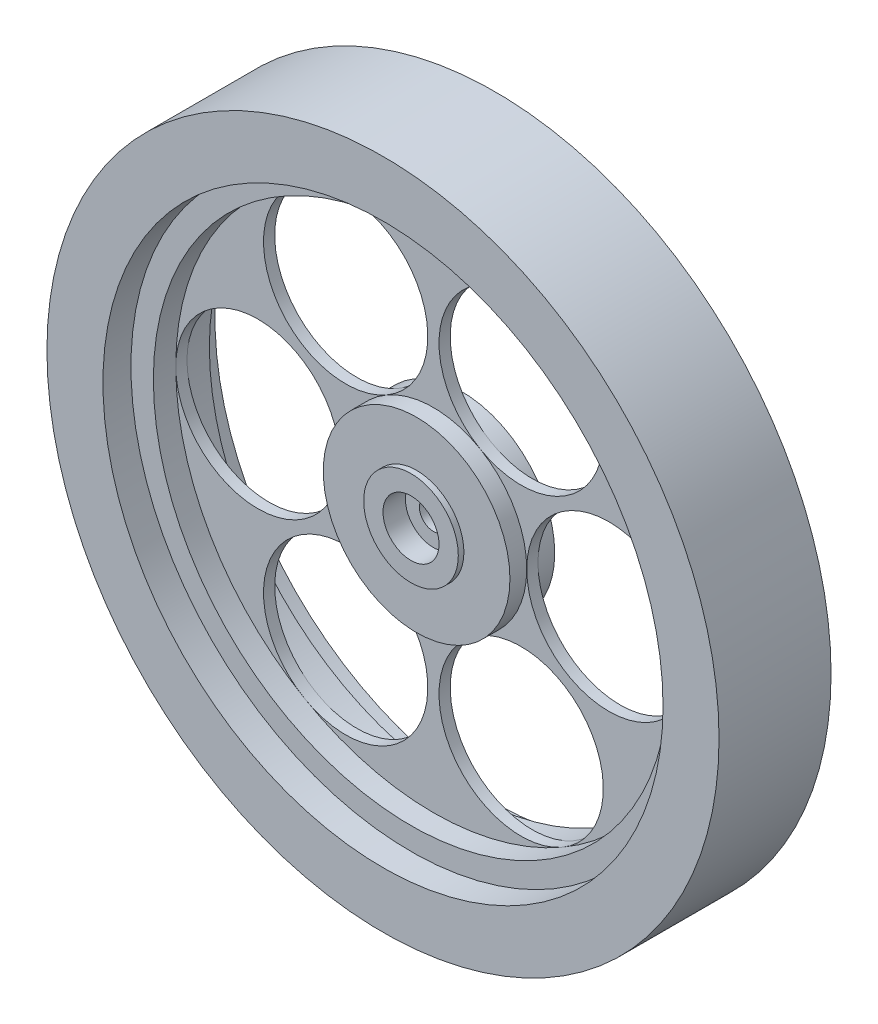
ISO-10303-21;
HEADER;
FILE_DESCRIPTION(('STEP AP214'),'2;1');
FILE_NAME('part.step','',(''),(''),'','','');
FILE_SCHEMA(('AUTOMOTIVE_DESIGN { 1 0 10303 214 1 1 1 1 }'));
ENDSEC;
DATA;
#1=APPLICATION_CONTEXT('core data for automotive mechanical design processes');
#2=APPLICATION_PROTOCOL_DEFINITION('international standard','automotive_design',2000,#1);
#3=PRODUCT_CONTEXT('',#1,'mechanical');
#4=PRODUCT('Part','Part','',(#3));
#5=PRODUCT_RELATED_PRODUCT_CATEGORY('part','',(#4));
#6=PRODUCT_DEFINITION_FORMATION('','',#4);
#7=PRODUCT_DEFINITION_CONTEXT('part definition',#1,'design');
#8=PRODUCT_DEFINITION('design','',#6,#7);
#9=PRODUCT_DEFINITION_SHAPE('','',#8);
#10=(LENGTH_UNIT() NAMED_UNIT(*) SI_UNIT(.MILLI.,.METRE.));
#11=(NAMED_UNIT(*) PLANE_ANGLE_UNIT() SI_UNIT($,.RADIAN.));
#12=(NAMED_UNIT(*) SI_UNIT($,.STERADIAN.) SOLID_ANGLE_UNIT());
#13=UNCERTAINTY_MEASURE_WITH_UNIT(LENGTH_MEASURE(1.E-05),#10,'distance_accuracy_value','');
#14=(GEOMETRIC_REPRESENTATION_CONTEXT(3) GLOBAL_UNCERTAINTY_ASSIGNED_CONTEXT((#13)) GLOBAL_UNIT_ASSIGNED_CONTEXT((#10,
#11,#12)) REPRESENTATION_CONTEXT('',''));
#15=CARTESIAN_POINT('',(0.,0.,0.));
#16=DIRECTION('',(0.,0.,1.));
#17=DIRECTION('',(1.,0.,0.));
#18=AXIS2_PLACEMENT_3D('',#15,#16,#17);
#19=CARTESIAN_POINT('',(0.,0.,2.54));
#20=DIRECTION('',(0.,0.,-1.));
#21=DIRECTION('',(-1.,0.,0.));
#22=AXIS2_PLACEMENT_3D('',#19,#20,#21);
#23=CYLINDRICAL_SURFACE('',#22,10.5833333333334);
#24=CARTESIAN_POINT('',(0.,0.,-2.54));
#25=DIRECTION('',(0.,0.,1.));
#26=DIRECTION('',(1.,0.,0.));
#27=AXIS2_PLACEMENT_3D('',#24,#25,#26);
#28=CIRCLE('',#27,10.5833333333334);
#29=CARTESIAN_POINT('',(10.5833333333334,0.,-2.54));
#30=VERTEX_POINT('',#29);
#31=EDGE_CURVE('E284',#30,#30,#28,.T.);
#32=ORIENTED_EDGE('',*,*,#31,.T.);
#33=EDGE_LOOP('',(#32));
#34=FACE_BOUND('',#33,.T.);
#35=CARTESIAN_POINT('',(0.,0.,-0.635));
#36=DIRECTION('',(0.,0.,1.));
#37=DIRECTION('',(1.,0.,0.));
#38=AXIS2_PLACEMENT_3D('',#35,#36,#37);
#39=CIRCLE('',#38,10.5833333333334);
#40=CARTESIAN_POINT('',(5.29166666666672,9.16543552338536,-0.635));
#41=VERTEX_POINT('',#40);
#42=CARTESIAN_POINT('',(-5.29166666666674,9.16543552338534,-0.635));
#43=VERTEX_POINT('',#42);
#44=EDGE_CURVE('E370',#41,#43,#39,.T.);
#45=ORIENTED_EDGE('',*,*,#44,.F.);
#46=CARTESIAN_POINT('',(0.,0.,-0.635));
#47=DIRECTION('',(0.,0.,1.));
#48=DIRECTION('',(1.,0.,0.));
#49=AXIS2_PLACEMENT_3D('',#46,#47,#48);
#50=CIRCLE('',#49,10.5833333333334);
#51=CARTESIAN_POINT('',(10.5833333333334,0.,-0.635));
#52=VERTEX_POINT('',#51);
#53=EDGE_CURVE('E265',#52,#41,#50,.T.);
#54=ORIENTED_EDGE('',*,*,#53,.F.);
#55=CARTESIAN_POINT('',(0.,0.,-0.635));
#56=DIRECTION('',(0.,0.,1.));
#57=DIRECTION('',(1.,0.,0.));
#58=AXIS2_PLACEMENT_3D('',#55,#56,#57);
#59=CIRCLE('',#58,10.5833333333334);
#60=CARTESIAN_POINT('',(5.29166666666676,-9.16543552338534,-0.635));
#61=VERTEX_POINT('',#60);
#62=EDGE_CURVE('E162',#61,#52,#59,.T.);
#63=ORIENTED_EDGE('',*,*,#62,.F.);
#64=CARTESIAN_POINT('',(0.,0.,-0.635));
#65=DIRECTION('',(0.,0.,1.));
#66=DIRECTION('',(1.,0.,0.));
#67=AXIS2_PLACEMENT_3D('',#64,#65,#66);
#68=CIRCLE('',#67,10.5833333333334);
#69=CARTESIAN_POINT('',(-5.29166666666667,-9.16543552338538,-0.635));
#70=VERTEX_POINT('',#69);
#71=EDGE_CURVE('E286',#70,#61,#68,.T.);
#72=ORIENTED_EDGE('',*,*,#71,.F.);
#73=CARTESIAN_POINT('',(0.,0.,-0.635));
#74=DIRECTION('',(0.,0.,1.));
#75=DIRECTION('',(1.,0.,0.));
#76=AXIS2_PLACEMENT_3D('',#73,#74,#75);
#77=CIRCLE('',#76,10.5833333333334);
#78=CARTESIAN_POINT('',(-10.5833333333334,0.,-0.635));
#79=VERTEX_POINT('',#78);
#80=EDGE_CURVE('E340',#79,#70,#77,.T.);
#81=ORIENTED_EDGE('',*,*,#80,.F.);
#82=CARTESIAN_POINT('',(0.,0.,-0.635));
#83=DIRECTION('',(0.,0.,1.));
#84=DIRECTION('',(1.,0.,0.));
#85=AXIS2_PLACEMENT_3D('',#82,#83,#84);
#86=CIRCLE('',#85,10.5833333333334);
#87=EDGE_CURVE('E312',#43,#79,#86,.T.);
#88=ORIENTED_EDGE('',*,*,#87,.F.);
#89=EDGE_LOOP('',(#45,#54,#63,#72,#81,#88));
#90=FACE_BOUND('',#89,.T.);
#91=ADVANCED_FACE('F137',(#34,#90),#23,.T.);
#92=CARTESIAN_POINT('',(-19.8966666666667,0.,0.635));
#93=DIRECTION('',(0.,0.,-1.));
#94=DIRECTION('',(-1.,0.,0.));
#95=AXIS2_PLACEMENT_3D('',#92,#93,#94);
#96=CYLINDRICAL_SURFACE('',#95,9.3133333333333);
#97=CARTESIAN_POINT('',(-19.8966666666667,0.,-0.635));
#98=DIRECTION('',(0.,0.,1.));
#99=DIRECTION('',(1.,0.,0.));
#100=AXIS2_PLACEMENT_3D('',#97,#98,#99);
#101=CIRCLE('',#100,9.3133333333333);
#102=CARTESIAN_POINT('',(-29.21,0.,-0.635));
#103=VERTEX_POINT('',#102);
#104=EDGE_CURVE('E332',#103,#79,#101,.T.);
#105=ORIENTED_EDGE('',*,*,#104,.F.);
#106=CARTESIAN_POINT('',(-19.8966666666667,0.,-0.635));
#107=DIRECTION('',(0.,0.,1.));
#108=DIRECTION('',(1.,0.,0.));
#109=AXIS2_PLACEMENT_3D('',#106,#107,#108);
#110=CIRCLE('',#109,9.3133333333333);
#111=EDGE_CURVE('E300',#79,#103,#110,.T.);
#112=ORIENTED_EDGE('',*,*,#111,.F.);
#113=EDGE_LOOP('',(#105,#112));
#114=FACE_BOUND('',#113,.T.);
#115=CARTESIAN_POINT('',(-19.8966666666667,0.,0.635));
#116=DIRECTION('',(0.,0.,1.));
#117=DIRECTION('',(1.,0.,0.));
#118=AXIS2_PLACEMENT_3D('',#115,#116,#117);
#119=CIRCLE('',#118,9.3133333333333);
#120=CARTESIAN_POINT('',(-10.5833333333334,0.,0.635));
#121=VERTEX_POINT('',#120);
#122=CARTESIAN_POINT('',(-29.21,0.,0.635));
#123=VERTEX_POINT('',#122);
#124=EDGE_CURVE('E303',#121,#123,#119,.T.);
#125=ORIENTED_EDGE('',*,*,#124,.T.);
#126=CARTESIAN_POINT('',(-19.8966666666667,0.,0.635));
#127=DIRECTION('',(0.,0.,1.));
#128=DIRECTION('',(1.,0.,0.));
#129=AXIS2_PLACEMENT_3D('',#126,#127,#128);
#130=CIRCLE('',#129,9.3133333333333);
#131=EDGE_CURVE('E421',#123,#121,#130,.T.);
#132=ORIENTED_EDGE('',*,*,#131,.T.);
#133=EDGE_LOOP('',(#125,#132));
#134=FACE_BOUND('',#133,.T.);
#135=ADVANCED_FACE('F139',(#114,#134),#96,.F.);
#136=CARTESIAN_POINT('',(-9.94833333333342,17.2310187839644,0.635));
#137=DIRECTION('',(0.,0.,-1.));
#138=DIRECTION('',(-1.,0.,0.));
#139=AXIS2_PLACEMENT_3D('',#136,#137,#138);
#140=CYLINDRICAL_SURFACE('',#139,9.3133333333333);
#141=CARTESIAN_POINT('',(-9.94833333333342,17.2310187839644,-0.635));
#142=DIRECTION('',(0.,0.,1.));
#143=DIRECTION('',(1.,0.,0.));
#144=AXIS2_PLACEMENT_3D('',#141,#142,#143);
#145=CIRCLE('',#144,9.3133333333333);
#146=CARTESIAN_POINT('',(-14.6050000000001,25.2966020445434,-0.635));
#147=VERTEX_POINT('',#146);
#148=EDGE_CURVE('E314',#147,#43,#145,.T.);
#149=ORIENTED_EDGE('',*,*,#148,.F.);
#150=CARTESIAN_POINT('',(-9.94833333333342,17.2310187839644,-0.635));
#151=DIRECTION('',(0.,0.,1.));
#152=DIRECTION('',(1.,0.,0.));
#153=AXIS2_PLACEMENT_3D('',#150,#151,#152);
#154=CIRCLE('',#153,9.3133333333333);
#155=EDGE_CURVE('E348',#43,#147,#154,.T.);
#156=ORIENTED_EDGE('',*,*,#155,.F.);
#157=EDGE_LOOP('',(#149,#156));
#158=FACE_BOUND('',#157,.T.);
#159=CARTESIAN_POINT('',(-9.94833333333342,17.2310187839644,0.635));
#160=DIRECTION('',(0.,0.,1.));
#161=DIRECTION('',(1.,0.,0.));
#162=AXIS2_PLACEMENT_3D('',#159,#160,#161);
#163=CIRCLE('',#162,9.3133333333333);
#164=CARTESIAN_POINT('',(-5.29166666666674,9.16543552338535,0.635));
#165=VERTEX_POINT('',#164);
#166=CARTESIAN_POINT('',(-14.6050000000001,25.2966020445434,0.635));
#167=VERTEX_POINT('',#166);
#168=EDGE_CURVE('E356',#165,#167,#163,.T.);
#169=ORIENTED_EDGE('',*,*,#168,.T.);
#170=CARTESIAN_POINT('',(-9.94833333333342,17.2310187839644,0.635));
#171=DIRECTION('',(0.,0.,1.));
#172=DIRECTION('',(1.,0.,0.));
#173=AXIS2_PLACEMENT_3D('',#170,#171,#172);
#174=CIRCLE('',#173,9.3133333333333);
#175=EDGE_CURVE('E146',#167,#165,#174,.T.);
#176=ORIENTED_EDGE('',*,*,#175,.T.);
#177=EDGE_LOOP('',(#169,#176));
#178=FACE_BOUND('',#177,.T.);
#179=ADVANCED_FACE('F484',(#158,#178),#140,.F.);
#180=CARTESIAN_POINT('',(0.,0.,0.635));
#181=DIRECTION('',(0.,0.,1.));
#182=DIRECTION('',(1.,0.,0.));
#183=AXIS2_PLACEMENT_3D('',#180,#181,#182);
#184=PLANE('',#183);
#185=ORIENTED_EDGE('',*,*,#124,.F.);
#186=CARTESIAN_POINT('',(0.,0.,0.635));
#187=DIRECTION('',(0.,0.,1.));
#188=DIRECTION('',(1.,0.,0.));
#189=AXIS2_PLACEMENT_3D('',#186,#187,#188);
#190=CIRCLE('',#189,10.5833333333334);
#191=EDGE_CURVE('E306',#165,#121,#190,.T.);
#192=ORIENTED_EDGE('',*,*,#191,.F.);
#193=ORIENTED_EDGE('',*,*,#175,.F.);
#194=CARTESIAN_POINT('',(0.,0.,0.635));
#195=DIRECTION('',(0.,0.,1.));
#196=DIRECTION('',(1.,0.,0.));
#197=AXIS2_PLACEMENT_3D('',#194,#195,#196);
#198=CIRCLE('',#197,29.21);
#199=EDGE_CURVE('E12',#167,#123,#198,.T.);
#200=ORIENTED_EDGE('',*,*,#199,.T.);
#201=EDGE_LOOP('',(#185,#192,#193,#200));
#202=FACE_BOUND('',#201,.T.);
#203=ADVANCED_FACE('F417',(#202),#184,.T.);
#204=CARTESIAN_POINT('',(0.,0.,-0.635));
#205=DIRECTION('',(0.,0.,1.));
#206=DIRECTION('',(1.,0.,0.));
#207=AXIS2_PLACEMENT_3D('',#204,#205,#206);
#208=PLANE('',#207);
#209=ORIENTED_EDGE('',*,*,#111,.T.);
#210=CARTESIAN_POINT('',(0.,0.,-0.635));
#211=DIRECTION('',(0.,0.,1.));
#212=DIRECTION('',(1.,0.,0.));
#213=AXIS2_PLACEMENT_3D('',#210,#211,#212);
#214=CIRCLE('',#213,29.21);
#215=EDGE_CURVE('E141',#147,#103,#214,.T.);
#216=ORIENTED_EDGE('',*,*,#215,.F.);
#217=ORIENTED_EDGE('',*,*,#148,.T.);
#218=ORIENTED_EDGE('',*,*,#87,.T.);
#219=EDGE_LOOP('',(#209,#216,#217,#218));
#220=FACE_BOUND('',#219,.T.);
#221=ADVANCED_FACE('F490',(#220),#208,.F.);
#222=CARTESIAN_POINT('',(0.,0.,0.635));
#223=DIRECTION('',(0.,0.,1.));
#224=DIRECTION('',(1.,0.,0.));
#225=AXIS2_PLACEMENT_3D('',#222,#223,#224);
#226=CIRCLE('',#225,10.5833333333334);
#227=CARTESIAN_POINT('',(10.5833333333334,0.,0.635));
#228=VERTEX_POINT('',#227);
#229=CARTESIAN_POINT('',(5.29166666666676,9.16543552338542,0.635));
#230=VERTEX_POINT('',#229);
#231=EDGE_CURVE('E154',#228,#230,#226,.T.);
#232=ORIENTED_EDGE('',*,*,#231,.T.);
#233=CARTESIAN_POINT('',(0.,0.,0.635));
#234=DIRECTION('',(0.,0.,1.));
#235=DIRECTION('',(1.,0.,0.));
#236=AXIS2_PLACEMENT_3D('',#233,#234,#235);
#237=CIRCLE('',#236,10.5833333333334);
#238=EDGE_CURVE('E359',#230,#165,#237,.T.);
#239=ORIENTED_EDGE('',*,*,#238,.T.);
#240=ORIENTED_EDGE('',*,*,#191,.T.);
#241=CARTESIAN_POINT('',(0.,0.,0.635));
#242=DIRECTION('',(0.,0.,1.));
#243=DIRECTION('',(1.,0.,0.));
#244=AXIS2_PLACEMENT_3D('',#241,#242,#243);
#245=CIRCLE('',#244,10.5833333333334);
#246=CARTESIAN_POINT('',(-5.29166666666668,-9.16543552338539,0.635));
#247=VERTEX_POINT('',#246);
#248=EDGE_CURVE('E425',#121,#247,#245,.T.);
#249=ORIENTED_EDGE('',*,*,#248,.T.);
#250=CARTESIAN_POINT('',(0.,0.,0.635));
#251=DIRECTION('',(0.,0.,1.));
#252=DIRECTION('',(1.,0.,0.));
#253=AXIS2_PLACEMENT_3D('',#250,#251,#252);
#254=CIRCLE('',#253,10.5833333333334);
#255=CARTESIAN_POINT('',(5.29166666666676,-9.16543552338534,0.635));
#256=VERTEX_POINT('',#255);
#257=EDGE_CURVE('E244',#247,#256,#254,.T.);
#258=ORIENTED_EDGE('',*,*,#257,.T.);
#259=CARTESIAN_POINT('',(0.,0.,0.635));
#260=DIRECTION('',(0.,0.,1.));
#261=DIRECTION('',(1.,0.,0.));
#262=AXIS2_PLACEMENT_3D('',#259,#260,#261);
#263=CIRCLE('',#262,10.5833333333334);
#264=EDGE_CURVE('E233',#256,#228,#263,.T.);
#265=ORIENTED_EDGE('',*,*,#264,.T.);
#266=EDGE_LOOP('',(#232,#239,#240,#249,#258,#265));
#267=FACE_BOUND('',#266,.T.);
#268=CARTESIAN_POINT('',(0.,0.,2.54));
#269=DIRECTION('',(0.,0.,1.));
#270=DIRECTION('',(1.,0.,0.));
#271=AXIS2_PLACEMENT_3D('',#268,#269,#270);
#272=CIRCLE('',#271,10.5833333333334);
#273=CARTESIAN_POINT('',(10.5833333333334,0.,2.54));
#274=VERTEX_POINT('',#273);
#275=EDGE_CURVE('E297',#274,#274,#272,.T.);
#276=ORIENTED_EDGE('',*,*,#275,.F.);
#277=EDGE_LOOP('',(#276));
#278=FACE_BOUND('',#277,.T.);
#279=ADVANCED_FACE('F240',(#267,#278),#23,.T.);
#280=CARTESIAN_POINT('',(0.,0.,2.54));
#281=DIRECTION('',(0.,0.,1.));
#282=DIRECTION('',(1.,0.,0.));
#283=AXIS2_PLACEMENT_3D('',#280,#281,#282);
#284=PLANE('',#283);
#285=CARTESIAN_POINT('',(0.,0.,2.54));
#286=DIRECTION('',(0.,0.,1.));
#287=DIRECTION('',(1.,0.,0.));
#288=AXIS2_PLACEMENT_3D('',#285,#286,#287);
#289=CIRCLE('',#288,5.36395316401893);
#290=CARTESIAN_POINT('',(5.36395316401893,0.,2.54));
#291=VERTEX_POINT('',#290);
#292=EDGE_CURVE('E294',#291,#291,#289,.T.);
#293=ORIENTED_EDGE('',*,*,#292,.F.);
#294=EDGE_LOOP('',(#293));
#295=FACE_BOUND('',#294,.T.);
#296=ORIENTED_EDGE('',*,*,#275,.T.);
#297=EDGE_LOOP('',(#296));
#298=FACE_BOUND('',#297,.T.);
#299=ADVANCED_FACE('F489',(#295,#298),#284,.T.);
#300=CARTESIAN_POINT('',(0.,0.,-2.54));
#301=DIRECTION('',(0.,0.,1.));
#302=DIRECTION('',(1.,0.,0.));
#303=AXIS2_PLACEMENT_3D('',#300,#301,#302);
#304=PLANE('',#303);
#305=CARTESIAN_POINT('',(0.,0.,-2.54));
#306=DIRECTION('',(0.,0.,1.));
#307=DIRECTION('',(1.,0.,0.));
#308=AXIS2_PLACEMENT_3D('',#305,#306,#307);
#309=CIRCLE('',#308,5.36395316401893);
#310=CARTESIAN_POINT('',(5.36395316401893,0.,-2.54));
#311=VERTEX_POINT('',#310);
#312=EDGE_CURVE('E266',#311,#311,#309,.F.);
#313=ORIENTED_EDGE('',*,*,#312,.F.);
#314=EDGE_LOOP('',(#313));
#315=FACE_BOUND('',#314,.T.);
#316=ORIENTED_EDGE('',*,*,#31,.F.);
#317=EDGE_LOOP('',(#316));
#318=FACE_BOUND('',#317,.T.);
#319=ADVANCED_FACE('F495',(#315,#318),#304,.F.);
#320=CARTESIAN_POINT('',(9.94833333333346,-17.2310187839643,0.635));
#321=DIRECTION('',(0.,0.,-1.));
#322=DIRECTION('',(-1.,0.,0.));
#323=AXIS2_PLACEMENT_3D('',#320,#321,#322);
#324=CYLINDRICAL_SURFACE('',#323,9.3133333333333);
#325=CARTESIAN_POINT('',(9.94833333333346,-17.2310187839643,-0.635));
#326=DIRECTION('',(0.,0.,1.));
#327=DIRECTION('',(1.,0.,0.));
#328=AXIS2_PLACEMENT_3D('',#325,#326,#327);
#329=CIRCLE('',#328,9.3133333333333);
#330=CARTESIAN_POINT('',(14.6050000000002,-25.2966020445434,-0.635));
#331=VERTEX_POINT('',#330);
#332=EDGE_CURVE('E259',#61,#331,#329,.T.);
#333=ORIENTED_EDGE('',*,*,#332,.F.);
#334=CARTESIAN_POINT('',(9.94833333333346,-17.2310187839643,-0.635));
#335=DIRECTION('',(0.,0.,1.));
#336=DIRECTION('',(1.,0.,0.));
#337=AXIS2_PLACEMENT_3D('',#334,#335,#336);
#338=CIRCLE('',#337,9.3133333333333);
#339=EDGE_CURVE('E438',#331,#61,#338,.T.);
#340=ORIENTED_EDGE('',*,*,#339,.F.);
#341=EDGE_LOOP('',(#333,#340));
#342=FACE_BOUND('',#341,.T.);
#343=CARTESIAN_POINT('',(9.94833333333346,-17.2310187839643,0.635));
#344=DIRECTION('',(0.,0.,1.));
#345=DIRECTION('',(1.,0.,0.));
#346=AXIS2_PLACEMENT_3D('',#343,#344,#345);
#347=CIRCLE('',#346,9.3133333333333);
#348=CARTESIAN_POINT('',(14.6050000000002,-25.2966020445434,0.635));
#349=VERTEX_POINT('',#348);
#350=EDGE_CURVE('E432',#349,#256,#347,.T.);
#351=ORIENTED_EDGE('',*,*,#350,.T.);
#352=CARTESIAN_POINT('',(9.94833333333346,-17.2310187839643,0.635));
#353=DIRECTION('',(0.,0.,1.));
#354=DIRECTION('',(1.,0.,0.));
#355=AXIS2_PLACEMENT_3D('',#352,#353,#354);
#356=CIRCLE('',#355,9.3133333333333);
#357=EDGE_CURVE('E274',#256,#349,#356,.T.);
#358=ORIENTED_EDGE('',*,*,#357,.T.);
#359=EDGE_LOOP('',(#351,#358));
#360=FACE_BOUND('',#359,.T.);
#361=ADVANCED_FACE('F524',(#342,#360),#324,.F.);
#362=CARTESIAN_POINT('',(-9.9483333333333,-17.2310187839644,0.635));
#363=DIRECTION('',(0.,0.,-1.));
#364=DIRECTION('',(-1.,0.,0.));
#365=AXIS2_PLACEMENT_3D('',#362,#363,#364);
#366=CYLINDRICAL_SURFACE('',#365,9.3133333333333);
#367=CARTESIAN_POINT('',(-9.9483333333333,-17.2310187839644,-0.635));
#368=DIRECTION('',(0.,0.,1.));
#369=DIRECTION('',(1.,0.,0.));
#370=AXIS2_PLACEMENT_3D('',#367,#368,#369);
#371=CIRCLE('',#370,9.3133333333333);
#372=CARTESIAN_POINT('',(-14.6049999999999,-25.2966020445435,-0.635));
#373=VERTEX_POINT('',#372);
#374=EDGE_CURVE('E246',#70,#373,#371,.T.);
#375=ORIENTED_EDGE('',*,*,#374,.F.);
#376=CARTESIAN_POINT('',(-9.9483333333333,-17.2310187839644,-0.635));
#377=DIRECTION('',(0.,0.,1.));
#378=DIRECTION('',(1.,0.,0.));
#379=AXIS2_PLACEMENT_3D('',#376,#377,#378);
#380=CIRCLE('',#379,9.3133333333333);
#381=EDGE_CURVE('E289',#373,#70,#380,.T.);
#382=ORIENTED_EDGE('',*,*,#381,.F.);
#383=EDGE_LOOP('',(#375,#382));
#384=FACE_BOUND('',#383,.T.);
#385=CARTESIAN_POINT('',(-9.9483333333333,-17.2310187839644,0.635));
#386=DIRECTION('',(0.,0.,1.));
#387=DIRECTION('',(1.,0.,0.));
#388=AXIS2_PLACEMENT_3D('',#385,#386,#387);
#389=CIRCLE('',#388,9.3133333333333);
#390=CARTESIAN_POINT('',(-14.6049999999999,-25.2966020445435,0.635));
#391=VERTEX_POINT('',#390);
#392=EDGE_CURVE('E279',#391,#247,#389,.T.);
#393=ORIENTED_EDGE('',*,*,#392,.T.);
#394=CARTESIAN_POINT('',(-9.9483333333333,-17.2310187839644,0.635));
#395=DIRECTION('',(0.,0.,1.));
#396=DIRECTION('',(1.,0.,0.));
#397=AXIS2_PLACEMENT_3D('',#394,#395,#396);
#398=CIRCLE('',#397,9.3133333333333);
#399=EDGE_CURVE('E335',#247,#391,#398,.T.);
#400=ORIENTED_EDGE('',*,*,#399,.T.);
#401=EDGE_LOOP('',(#393,#400));
#402=FACE_BOUND('',#401,.T.);
#403=ADVANCED_FACE('F515',(#384,#402),#366,.F.);
#404=CARTESIAN_POINT('',(0.,0.,0.635));
#405=DIRECTION('',(0.,0.,1.));
#406=DIRECTION('',(1.,0.,0.));
#407=AXIS2_PLACEMENT_3D('',#404,#405,#406);
#408=PLANE('',#407);
#409=ORIENTED_EDGE('',*,*,#357,.F.);
#410=ORIENTED_EDGE('',*,*,#257,.F.);
#411=ORIENTED_EDGE('',*,*,#392,.F.);
#412=CARTESIAN_POINT('',(0.,0.,0.635));
#413=DIRECTION('',(0.,0.,1.));
#414=DIRECTION('',(1.,0.,0.));
#415=AXIS2_PLACEMENT_3D('',#412,#413,#414);
#416=CIRCLE('',#415,29.21);
#417=EDGE_CURVE('E282',#391,#349,#416,.T.);
#418=ORIENTED_EDGE('',*,*,#417,.T.);
#419=EDGE_LOOP('',(#409,#410,#411,#418));
#420=FACE_BOUND('',#419,.T.);
#421=ADVANCED_FACE('F529',(#420),#408,.T.);
#422=CARTESIAN_POINT('',(0.,0.,-0.635));
#423=DIRECTION('',(0.,0.,1.));
#424=DIRECTION('',(1.,0.,0.));
#425=AXIS2_PLACEMENT_3D('',#422,#423,#424);
#426=PLANE('',#425);
#427=ORIENTED_EDGE('',*,*,#332,.T.);
#428=CARTESIAN_POINT('',(0.,0.,-0.635));
#429=DIRECTION('',(0.,0.,1.));
#430=DIRECTION('',(1.,0.,0.));
#431=AXIS2_PLACEMENT_3D('',#428,#429,#430);
#432=CIRCLE('',#431,29.21);
#433=EDGE_CURVE('E277',#373,#331,#432,.T.);
#434=ORIENTED_EDGE('',*,*,#433,.F.);
#435=ORIENTED_EDGE('',*,*,#381,.T.);
#436=ORIENTED_EDGE('',*,*,#71,.T.);
#437=EDGE_LOOP('',(#427,#434,#435,#436));
#438=FACE_BOUND('',#437,.T.);
#439=ADVANCED_FACE('F518',(#438),#426,.F.);
#440=CARTESIAN_POINT('',(9.94833333333339,17.2310187839644,0.635));
#441=DIRECTION('',(0.,0.,-1.));
#442=DIRECTION('',(-1.,0.,0.));
#443=AXIS2_PLACEMENT_3D('',#440,#441,#442);
#444=CYLINDRICAL_SURFACE('',#443,9.31333333333323);
#445=CARTESIAN_POINT('',(9.94833333333339,17.2310187839644,-0.635));
#446=DIRECTION('',(0.,0.,1.));
#447=DIRECTION('',(1.,0.,0.));
#448=AXIS2_PLACEMENT_3D('',#445,#446,#447);
#449=CIRCLE('',#448,9.31333333333323);
#450=CARTESIAN_POINT('',(14.6050000000001,25.2966020445434,-0.635));
#451=VERTEX_POINT('',#450);
#452=EDGE_CURVE('E263',#41,#451,#449,.T.);
#453=ORIENTED_EDGE('',*,*,#452,.F.);
#454=CARTESIAN_POINT('',(9.94833333333339,17.2310187839644,-0.635));
#455=DIRECTION('',(0.,0.,1.));
#456=DIRECTION('',(1.,0.,0.));
#457=AXIS2_PLACEMENT_3D('',#454,#455,#456);
#458=CIRCLE('',#457,9.31333333333323);
#459=EDGE_CURVE('E373',#451,#41,#458,.T.);
#460=ORIENTED_EDGE('',*,*,#459,.F.);
#461=EDGE_LOOP('',(#453,#460));
#462=FACE_BOUND('',#461,.T.);
#463=CARTESIAN_POINT('',(9.94833333333339,17.2310187839644,0.635));
#464=DIRECTION('',(0.,0.,1.));
#465=DIRECTION('',(1.,0.,0.));
#466=AXIS2_PLACEMENT_3D('',#463,#464,#465);
#467=CIRCLE('',#466,9.31333333333323);
#468=CARTESIAN_POINT('',(14.6050000000001,25.2966020445434,0.635));
#469=VERTEX_POINT('',#468);
#470=EDGE_CURVE('E361',#469,#230,#467,.T.);
#471=ORIENTED_EDGE('',*,*,#470,.T.);
#472=CARTESIAN_POINT('',(9.94833333333339,17.2310187839644,0.635));
#473=DIRECTION('',(0.,0.,1.));
#474=DIRECTION('',(1.,0.,0.));
#475=AXIS2_PLACEMENT_3D('',#472,#473,#474);
#476=CIRCLE('',#475,9.31333333333323);
#477=EDGE_CURVE('E253',#230,#469,#476,.T.);
#478=ORIENTED_EDGE('',*,*,#477,.T.);
#479=EDGE_LOOP('',(#471,#478));
#480=FACE_BOUND('',#479,.T.);
#481=ADVANCED_FACE('F403',(#462,#480),#444,.F.);
#482=CARTESIAN_POINT('',(19.8966666666667,0.,0.635));
#483=DIRECTION('',(0.,0.,-1.));
#484=DIRECTION('',(-1.,0.,0.));
#485=AXIS2_PLACEMENT_3D('',#482,#483,#484);
#486=CYLINDRICAL_SURFACE('',#485,9.3133333333333);
#487=CARTESIAN_POINT('',(19.8966666666667,0.,-0.635));
#488=DIRECTION('',(0.,0.,1.));
#489=DIRECTION('',(1.,0.,0.));
#490=AXIS2_PLACEMENT_3D('',#487,#488,#489);
#491=CIRCLE('',#490,9.3133333333333);
#492=CARTESIAN_POINT('',(29.21,0.,-0.635));
#493=VERTEX_POINT('',#492);
#494=EDGE_CURVE('E433',#52,#493,#491,.T.);
#495=ORIENTED_EDGE('',*,*,#494,.F.);
#496=CARTESIAN_POINT('',(19.8966666666667,0.,-0.635));
#497=DIRECTION('',(0.,0.,1.));
#498=DIRECTION('',(1.,0.,0.));
#499=AXIS2_PLACEMENT_3D('',#496,#497,#498);
#500=CIRCLE('',#499,9.3133333333333);
#501=EDGE_CURVE('E268',#493,#52,#500,.T.);
#502=ORIENTED_EDGE('',*,*,#501,.F.);
#503=EDGE_LOOP('',(#495,#502));
#504=FACE_BOUND('',#503,.T.);
#505=CARTESIAN_POINT('',(19.8966666666667,0.,0.635));
#506=DIRECTION('',(0.,0.,1.));
#507=DIRECTION('',(1.,0.,0.));
#508=AXIS2_PLACEMENT_3D('',#505,#506,#507);
#509=CIRCLE('',#508,9.3133333333333);
#510=CARTESIAN_POINT('',(29.21,0.,0.635));
#511=VERTEX_POINT('',#510);
#512=EDGE_CURVE('E250',#511,#228,#509,.T.);
#513=ORIENTED_EDGE('',*,*,#512,.T.);
#514=CARTESIAN_POINT('',(19.8966666666667,0.,0.635));
#515=DIRECTION('',(0.,0.,1.));
#516=DIRECTION('',(1.,0.,0.));
#517=AXIS2_PLACEMENT_3D('',#514,#515,#516);
#518=CIRCLE('',#517,9.3133333333333);
#519=EDGE_CURVE('E230',#228,#511,#518,.T.);
#520=ORIENTED_EDGE('',*,*,#519,.T.);
#521=EDGE_LOOP('',(#513,#520));
#522=FACE_BOUND('',#521,.T.);
#523=ADVANCED_FACE('F256',(#504,#522),#486,.F.);
#524=CARTESIAN_POINT('',(0.,0.,0.635));
#525=DIRECTION('',(0.,0.,1.));
#526=DIRECTION('',(1.,0.,0.));
#527=AXIS2_PLACEMENT_3D('',#524,#525,#526);
#528=PLANE('',#527);
#529=ORIENTED_EDGE('',*,*,#477,.F.);
#530=ORIENTED_EDGE('',*,*,#231,.F.);
#531=ORIENTED_EDGE('',*,*,#512,.F.);
#532=CARTESIAN_POINT('',(0.,0.,0.635));
#533=DIRECTION('',(0.,0.,1.));
#534=DIRECTION('',(1.,0.,0.));
#535=AXIS2_PLACEMENT_3D('',#532,#533,#534);
#536=CIRCLE('',#535,29.21);
#537=EDGE_CURVE('E257',#511,#469,#536,.T.);
#538=ORIENTED_EDGE('',*,*,#537,.T.);
#539=EDGE_LOOP('',(#529,#530,#531,#538));
#540=FACE_BOUND('',#539,.T.);
#541=ADVANCED_FACE('F249',(#540),#528,.T.);
#542=CARTESIAN_POINT('',(0.,0.,-0.635));
#543=DIRECTION('',(0.,0.,1.));
#544=DIRECTION('',(1.,0.,0.));
#545=AXIS2_PLACEMENT_3D('',#542,#543,#544);
#546=PLANE('',#545);
#547=ORIENTED_EDGE('',*,*,#452,.T.);
#548=CARTESIAN_POINT('',(0.,0.,-0.635));
#549=DIRECTION('',(0.,0.,1.));
#550=DIRECTION('',(1.,0.,0.));
#551=AXIS2_PLACEMENT_3D('',#548,#549,#550);
#552=CIRCLE('',#551,29.21);
#553=EDGE_CURVE('E271',#493,#451,#552,.T.);
#554=ORIENTED_EDGE('',*,*,#553,.F.);
#555=ORIENTED_EDGE('',*,*,#501,.T.);
#556=ORIENTED_EDGE('',*,*,#53,.T.);
#557=EDGE_LOOP('',(#547,#554,#555,#556));
#558=FACE_BOUND('',#557,.T.);
#559=ADVANCED_FACE('F548',(#558),#546,.F.);
#560=CARTESIAN_POINT('',(0.,0.,3.175));
#561=DIRECTION('',(0.,0.,-1.));
#562=DIRECTION('',(-1.,0.,0.));
#563=AXIS2_PLACEMENT_3D('',#560,#561,#562);
#564=CYLINDRICAL_SURFACE('',#563,5.36395316401893);
#565=CARTESIAN_POINT('',(0.,0.,-3.175));
#566=DIRECTION('',(0.,0.,1.));
#567=DIRECTION('',(1.,0.,0.));
#568=AXIS2_PLACEMENT_3D('',#565,#566,#567);
#569=CIRCLE('',#568,5.36395316401893);
#570=CARTESIAN_POINT('',(5.36395316401893,0.,-3.175));
#571=VERTEX_POINT('',#570);
#572=EDGE_CURVE('E381',#571,#571,#569,.T.);
#573=ORIENTED_EDGE('',*,*,#572,.T.);
#574=EDGE_LOOP('',(#573));
#575=FACE_BOUND('',#574,.T.);
#576=ORIENTED_EDGE('',*,*,#312,.T.);
#577=EDGE_LOOP('',(#576));
#578=FACE_BOUND('',#577,.T.);
#579=ADVANCED_FACE('F545',(#575,#578),#564,.T.);
#580=CARTESIAN_POINT('',(0.,0.,0.635));
#581=DIRECTION('',(0.,0.,-1.));
#582=DIRECTION('',(-1.,0.,0.));
#583=AXIS2_PLACEMENT_3D('',#580,#581,#582);
#584=CYLINDRICAL_SURFACE('',#583,1.5875);
#585=CARTESIAN_POINT('',(0.,0.,0.635));
#586=DIRECTION('',(0.,0.,1.));
#587=DIRECTION('',(1.,0.,0.));
#588=AXIS2_PLACEMENT_3D('',#585,#586,#587);
#589=CIRCLE('',#588,1.5875);
#590=CARTESIAN_POINT('',(1.5875,0.,0.635));
#591=VERTEX_POINT('',#590);
#592=EDGE_CURVE('E392',#591,#591,#589,.T.);
#593=ORIENTED_EDGE('',*,*,#592,.T.);
#594=EDGE_LOOP('',(#593));
#595=FACE_BOUND('',#594,.T.);
#596=CARTESIAN_POINT('',(0.,0.,-0.635));
#597=DIRECTION('',(0.,0.,1.));
#598=DIRECTION('',(1.,0.,0.));
#599=AXIS2_PLACEMENT_3D('',#596,#597,#598);
#600=CIRCLE('',#599,1.5875);
#601=CARTESIAN_POINT('',(1.5875,0.,-0.635));
#602=VERTEX_POINT('',#601);
#603=EDGE_CURVE('E391',#602,#602,#600,.T.);
#604=ORIENTED_EDGE('',*,*,#603,.F.);
#605=EDGE_LOOP('',(#604));
#606=FACE_BOUND('',#605,.T.);
#607=ADVANCED_FACE('F547',(#595,#606),#584,.F.);
#608=CARTESIAN_POINT('',(0.,0.,0.635));
#609=DIRECTION('',(0.,0.,1.));
#610=DIRECTION('',(1.,0.,0.));
#611=AXIS2_PLACEMENT_3D('',#608,#609,#610);
#612=PLANE('',#611);
#613=ORIENTED_EDGE('',*,*,#592,.F.);
#614=EDGE_LOOP('',(#613));
#615=FACE_BOUND('',#614,.T.);
#616=CARTESIAN_POINT('',(0.,0.,0.635));
#617=DIRECTION('',(0.,0.,1.));
#618=DIRECTION('',(1.,0.,0.));
#619=AXIS2_PLACEMENT_3D('',#616,#617,#618);
#620=CIRCLE('',#619,3.175);
#621=CARTESIAN_POINT('',(3.175,0.,0.635));
#622=VERTEX_POINT('',#621);
#623=EDGE_CURVE('E384',#622,#622,#620,.F.);
#624=ORIENTED_EDGE('',*,*,#623,.F.);
#625=EDGE_LOOP('',(#624));
#626=FACE_BOUND('',#625,.T.);
#627=ADVANCED_FACE('F556',(#615,#626),#612,.T.);
#628=CARTESIAN_POINT('',(0.,0.,-0.635));
#629=DIRECTION('',(0.,0.,1.));
#630=DIRECTION('',(1.,0.,0.));
#631=AXIS2_PLACEMENT_3D('',#628,#629,#630);
#632=PLANE('',#631);
#633=ORIENTED_EDGE('',*,*,#603,.T.);
#634=EDGE_LOOP('',(#633));
#635=FACE_BOUND('',#634,.T.);
#636=CARTESIAN_POINT('',(0.,0.,-0.635));
#637=DIRECTION('',(0.,0.,1.));
#638=DIRECTION('',(1.,0.,0.));
#639=AXIS2_PLACEMENT_3D('',#636,#637,#638);
#640=CIRCLE('',#639,3.175);
#641=CARTESIAN_POINT('',(3.175,0.,-0.635));
#642=VERTEX_POINT('',#641);
#643=EDGE_CURVE('E395',#642,#642,#640,.T.);
#644=ORIENTED_EDGE('',*,*,#643,.F.);
#645=EDGE_LOOP('',(#644));
#646=FACE_BOUND('',#645,.T.);
#647=ADVANCED_FACE('F585',(#635,#646),#632,.F.);
#648=CARTESIAN_POINT('',(0.,0.,3.175));
#649=DIRECTION('',(0.,0.,-1.));
#650=DIRECTION('',(-1.,0.,0.));
#651=AXIS2_PLACEMENT_3D('',#648,#649,#650);
#652=CYLINDRICAL_SURFACE('',#651,3.175);
#653=CARTESIAN_POINT('',(0.,0.,-3.175));
#654=DIRECTION('',(0.,0.,1.));
#655=DIRECTION('',(1.,0.,0.));
#656=AXIS2_PLACEMENT_3D('',#653,#654,#655);
#657=CIRCLE('',#656,3.175);
#658=CARTESIAN_POINT('',(3.175,0.,-3.175));
#659=VERTEX_POINT('',#658);
#660=EDGE_CURVE('E367',#659,#659,#657,.T.);
#661=ORIENTED_EDGE('',*,*,#660,.F.);
#662=EDGE_LOOP('',(#661));
#663=FACE_BOUND('',#662,.T.);
#664=ORIENTED_EDGE('',*,*,#643,.T.);
#665=EDGE_LOOP('',(#664));
#666=FACE_BOUND('',#665,.T.);
#667=ADVANCED_FACE('F574',(#663,#666),#652,.F.);
#668=ORIENTED_EDGE('',*,*,#623,.T.);
#669=EDGE_LOOP('',(#668));
#670=FACE_BOUND('',#669,.T.);
#671=CARTESIAN_POINT('',(0.,0.,3.175));
#672=DIRECTION('',(0.,0.,1.));
#673=DIRECTION('',(1.,0.,0.));
#674=AXIS2_PLACEMENT_3D('',#671,#672,#673);
#675=CIRCLE('',#674,3.175);
#676=CARTESIAN_POINT('',(3.175,0.,3.175));
#677=VERTEX_POINT('',#676);
#678=EDGE_CURVE('E377',#677,#677,#675,.T.);
#679=ORIENTED_EDGE('',*,*,#678,.T.);
#680=EDGE_LOOP('',(#679));
#681=FACE_BOUND('',#680,.T.);
#682=ADVANCED_FACE('F565',(#670,#681),#652,.F.);
#683=ORIENTED_EDGE('',*,*,#292,.T.);
#684=EDGE_LOOP('',(#683));
#685=FACE_BOUND('',#684,.T.);
#686=CARTESIAN_POINT('',(0.,0.,3.175));
#687=DIRECTION('',(0.,0.,1.));
#688=DIRECTION('',(1.,0.,0.));
#689=AXIS2_PLACEMENT_3D('',#686,#687,#688);
#690=CIRCLE('',#689,5.36395316401893);
#691=CARTESIAN_POINT('',(5.36395316401893,0.,3.175));
#692=VERTEX_POINT('',#691);
#693=EDGE_CURVE('E380',#692,#692,#690,.T.);
#694=ORIENTED_EDGE('',*,*,#693,.F.);
#695=EDGE_LOOP('',(#694));
#696=FACE_BOUND('',#695,.T.);
#697=ADVANCED_FACE('F551',(#685,#696),#564,.T.);
#698=CARTESIAN_POINT('',(0.,0.,3.175));
#699=DIRECTION('',(0.,0.,1.));
#700=DIRECTION('',(1.,0.,0.));
#701=AXIS2_PLACEMENT_3D('',#698,#699,#700);
#702=PLANE('',#701);
#703=ORIENTED_EDGE('',*,*,#678,.F.);
#704=EDGE_LOOP('',(#703));
#705=FACE_BOUND('',#704,.T.);
#706=ORIENTED_EDGE('',*,*,#693,.T.);
#707=EDGE_LOOP('',(#706));
#708=FACE_BOUND('',#707,.T.);
#709=ADVANCED_FACE('F564',(#705,#708),#702,.T.);
#710=CARTESIAN_POINT('',(0.,0.,-3.175));
#711=DIRECTION('',(0.,0.,1.));
#712=DIRECTION('',(1.,0.,0.));
#713=AXIS2_PLACEMENT_3D('',#710,#711,#712);
#714=PLANE('',#713);
#715=ORIENTED_EDGE('',*,*,#660,.T.);
#716=EDGE_LOOP('',(#715));
#717=FACE_BOUND('',#716,.T.);
#718=ORIENTED_EDGE('',*,*,#572,.F.);
#719=EDGE_LOOP('',(#718));
#720=FACE_BOUND('',#719,.T.);
#721=ADVANCED_FACE('F571',(#717,#720),#714,.F.);
#722=CARTESIAN_POINT('',(0.,0.,3.175));
#723=DIRECTION('',(0.,0.,-1.));
#724=DIRECTION('',(-1.,0.,0.));
#725=AXIS2_PLACEMENT_3D('',#722,#723,#724);
#726=CYLINDRICAL_SURFACE('',#725,29.21);
#727=CARTESIAN_POINT('',(0.,0.,-3.175));
#728=DIRECTION('',(0.,0.,1.));
#729=DIRECTION('',(1.,0.,0.));
#730=AXIS2_PLACEMENT_3D('',#727,#728,#729);
#731=CIRCLE('',#730,29.21);
#732=CARTESIAN_POINT('',(29.21,0.,-3.175));
#733=VERTEX_POINT('',#732);
#734=EDGE_CURVE('E350',#733,#733,#731,.T.);
#735=ORIENTED_EDGE('',*,*,#734,.F.);
#736=EDGE_LOOP('',(#735));
#737=FACE_BOUND('',#736,.T.);
#738=ORIENTED_EDGE('',*,*,#215,.T.);
#739=CARTESIAN_POINT('',(0.,0.,-0.635));
#740=DIRECTION('',(0.,0.,1.));
#741=DIRECTION('',(1.,0.,0.));
#742=AXIS2_PLACEMENT_3D('',#739,#740,#741);
#743=CIRCLE('',#742,29.21);
#744=EDGE_CURVE('E325',#103,#373,#743,.T.);
#745=ORIENTED_EDGE('',*,*,#744,.T.);
#746=ORIENTED_EDGE('',*,*,#433,.T.);
#747=CARTESIAN_POINT('',(0.,0.,-0.635));
#748=DIRECTION('',(0.,0.,1.));
#749=DIRECTION('',(1.,0.,0.));
#750=AXIS2_PLACEMENT_3D('',#747,#748,#749);
#751=CIRCLE('',#750,29.21);
#752=EDGE_CURVE('E435',#331,#493,#751,.T.);
#753=ORIENTED_EDGE('',*,*,#752,.T.);
#754=ORIENTED_EDGE('',*,*,#553,.T.);
#755=CARTESIAN_POINT('',(0.,0.,-0.635));
#756=DIRECTION('',(0.,0.,1.));
#757=DIRECTION('',(1.,0.,0.));
#758=AXIS2_PLACEMENT_3D('',#755,#756,#757);
#759=CIRCLE('',#758,29.21);
#760=EDGE_CURVE('E327',#451,#147,#759,.T.);
#761=ORIENTED_EDGE('',*,*,#760,.T.);
#762=EDGE_LOOP('',(#738,#745,#746,#753,#754,#761));
#763=FACE_BOUND('',#762,.T.);
#764=ADVANCED_FACE('F324',(#737,#763),#726,.F.);
#765=CARTESIAN_POINT('',(0.,0.,0.635));
#766=DIRECTION('',(0.,0.,1.));
#767=DIRECTION('',(1.,0.,0.));
#768=AXIS2_PLACEMENT_3D('',#765,#766,#767);
#769=PLANE('',#768);
#770=ORIENTED_EDGE('',*,*,#168,.F.);
#771=ORIENTED_EDGE('',*,*,#238,.F.);
#772=ORIENTED_EDGE('',*,*,#470,.F.);
#773=CARTESIAN_POINT('',(0.,0.,0.635));
#774=DIRECTION('',(0.,0.,1.));
#775=DIRECTION('',(1.,0.,0.));
#776=AXIS2_PLACEMENT_3D('',#773,#774,#775);
#777=CIRCLE('',#776,29.21);
#778=EDGE_CURVE('E364',#469,#167,#777,.T.);
#779=ORIENTED_EDGE('',*,*,#778,.T.);
#780=EDGE_LOOP('',(#770,#771,#772,#779));
#781=FACE_BOUND('',#780,.T.);
#782=ADVANCED_FACE('F407',(#781),#769,.T.);
#783=CARTESIAN_POINT('',(0.,0.,-0.635));
#784=DIRECTION('',(0.,0.,1.));
#785=DIRECTION('',(1.,0.,0.));
#786=AXIS2_PLACEMENT_3D('',#783,#784,#785);
#787=PLANE('',#786);
#788=ORIENTED_EDGE('',*,*,#155,.T.);
#789=ORIENTED_EDGE('',*,*,#760,.F.);
#790=ORIENTED_EDGE('',*,*,#459,.T.);
#791=ORIENTED_EDGE('',*,*,#44,.T.);
#792=EDGE_LOOP('',(#788,#789,#790,#791));
#793=FACE_BOUND('',#792,.T.);
#794=ADVANCED_FACE('F508',(#793),#787,.F.);
#795=CARTESIAN_POINT('',(0.,0.,0.635));
#796=DIRECTION('',(0.,0.,1.));
#797=DIRECTION('',(1.,0.,0.));
#798=AXIS2_PLACEMENT_3D('',#795,#796,#797);
#799=CIRCLE('',#798,29.21);
#800=EDGE_CURVE('E353',#123,#391,#799,.T.);
#801=ORIENTED_EDGE('',*,*,#800,.F.);
#802=ORIENTED_EDGE('',*,*,#199,.F.);
#803=ORIENTED_EDGE('',*,*,#778,.F.);
#804=ORIENTED_EDGE('',*,*,#537,.F.);
#805=CARTESIAN_POINT('',(0.,0.,0.635));
#806=DIRECTION('',(0.,0.,1.));
#807=DIRECTION('',(1.,0.,0.));
#808=AXIS2_PLACEMENT_3D('',#805,#806,#807);
#809=CIRCLE('',#808,29.21);
#810=EDGE_CURVE('E236',#349,#511,#809,.T.);
#811=ORIENTED_EDGE('',*,*,#810,.F.);
#812=ORIENTED_EDGE('',*,*,#417,.F.);
#813=EDGE_LOOP('',(#801,#802,#803,#804,#811,#812));
#814=FACE_BOUND('',#813,.T.);
#815=CARTESIAN_POINT('',(0.,0.,3.175));
#816=DIRECTION('',(0.,0.,1.));
#817=DIRECTION('',(1.,0.,0.));
#818=AXIS2_PLACEMENT_3D('',#815,#816,#817);
#819=CIRCLE('',#818,29.21);
#820=CARTESIAN_POINT('',(29.21,0.,3.175));
#821=VERTEX_POINT('',#820);
#822=EDGE_CURVE('E345',#821,#821,#819,.T.);
#823=ORIENTED_EDGE('',*,*,#822,.T.);
#824=EDGE_LOOP('',(#823));
#825=FACE_BOUND('',#824,.T.);
#826=ADVANCED_FACE('F411',(#814,#825),#726,.F.);
#827=CARTESIAN_POINT('',(0.,0.,3.175));
#828=DIRECTION('',(0.,0.,1.));
#829=DIRECTION('',(1.,0.,0.));
#830=AXIS2_PLACEMENT_3D('',#827,#828,#829);
#831=PLANE('',#830);
#832=ORIENTED_EDGE('',*,*,#822,.F.);
#833=EDGE_LOOP('',(#832));
#834=FACE_BOUND('',#833,.T.);
#835=CARTESIAN_POINT('',(0.,0.,3.175));
#836=DIRECTION('',(0.,0.,1.));
#837=DIRECTION('',(1.,0.,0.));
#838=AXIS2_PLACEMENT_3D('',#835,#836,#837);
#839=CIRCLE('',#838,31.75);
#840=CARTESIAN_POINT('',(31.75,0.,3.175));
#841=VERTEX_POINT('',#840);
#842=EDGE_CURVE('E439',#841,#841,#839,.F.);
#843=ORIENTED_EDGE('',*,*,#842,.F.);
#844=EDGE_LOOP('',(#843));
#845=FACE_BOUND('',#844,.T.);
#846=ADVANCED_FACE('F741',(#834,#845),#831,.T.);
#847=CARTESIAN_POINT('',(0.,0.,-3.175));
#848=DIRECTION('',(0.,0.,1.));
#849=DIRECTION('',(1.,0.,0.));
#850=AXIS2_PLACEMENT_3D('',#847,#848,#849);
#851=PLANE('',#850);
#852=ORIENTED_EDGE('',*,*,#734,.T.);
#853=EDGE_LOOP('',(#852));
#854=FACE_BOUND('',#853,.T.);
#855=CARTESIAN_POINT('',(0.,0.,-3.175));
#856=DIRECTION('',(0.,0.,1.));
#857=DIRECTION('',(1.,0.,0.));
#858=AXIS2_PLACEMENT_3D('',#855,#856,#857);
#859=CIRCLE('',#858,31.75);
#860=CARTESIAN_POINT('',(31.75,0.,-3.175));
#861=VERTEX_POINT('',#860);
#862=EDGE_CURVE('E349',#861,#861,#859,.T.);
#863=ORIENTED_EDGE('',*,*,#862,.F.);
#864=EDGE_LOOP('',(#863));
#865=FACE_BOUND('',#864,.T.);
#866=ADVANCED_FACE('F734',(#854,#865),#851,.F.);
#867=CARTESIAN_POINT('',(0.,0.,0.635));
#868=DIRECTION('',(0.,0.,1.));
#869=DIRECTION('',(1.,0.,0.));
#870=AXIS2_PLACEMENT_3D('',#867,#868,#869);
#871=PLANE('',#870);
#872=ORIENTED_EDGE('',*,*,#399,.F.);
#873=ORIENTED_EDGE('',*,*,#248,.F.);
#874=ORIENTED_EDGE('',*,*,#131,.F.);
#875=ORIENTED_EDGE('',*,*,#800,.T.);
#876=EDGE_LOOP('',(#872,#873,#874,#875));
#877=FACE_BOUND('',#876,.T.);
#878=ADVANCED_FACE('F423',(#877),#871,.T.);
#879=CARTESIAN_POINT('',(0.,0.,-0.635));
#880=DIRECTION('',(0.,0.,1.));
#881=DIRECTION('',(1.,0.,0.));
#882=AXIS2_PLACEMENT_3D('',#879,#880,#881);
#883=PLANE('',#882);
#884=ORIENTED_EDGE('',*,*,#374,.T.);
#885=ORIENTED_EDGE('',*,*,#744,.F.);
#886=ORIENTED_EDGE('',*,*,#104,.T.);
#887=ORIENTED_EDGE('',*,*,#80,.T.);
#888=EDGE_LOOP('',(#884,#885,#886,#887));
#889=FACE_BOUND('',#888,.T.);
#890=ADVANCED_FACE('F331',(#889),#883,.F.);
#891=CARTESIAN_POINT('',(0.,0.,0.635));
#892=DIRECTION('',(0.,0.,1.));
#893=DIRECTION('',(1.,0.,0.));
#894=AXIS2_PLACEMENT_3D('',#891,#892,#893);
#895=PLANE('',#894);
#896=ORIENTED_EDGE('',*,*,#350,.F.);
#897=ORIENTED_EDGE('',*,*,#810,.T.);
#898=ORIENTED_EDGE('',*,*,#519,.F.);
#899=ORIENTED_EDGE('',*,*,#264,.F.);
#900=EDGE_LOOP('',(#896,#897,#898,#899));
#901=FACE_BOUND('',#900,.T.);
#902=ADVANCED_FACE('F232',(#901),#895,.T.);
#903=CARTESIAN_POINT('',(0.,0.,-0.635));
#904=DIRECTION('',(0.,0.,1.));
#905=DIRECTION('',(1.,0.,0.));
#906=AXIS2_PLACEMENT_3D('',#903,#904,#905);
#907=PLANE('',#906);
#908=ORIENTED_EDGE('',*,*,#339,.T.);
#909=ORIENTED_EDGE('',*,*,#62,.T.);
#910=ORIENTED_EDGE('',*,*,#494,.T.);
#911=ORIENTED_EDGE('',*,*,#752,.F.);
#912=EDGE_LOOP('',(#908,#909,#910,#911));
#913=FACE_BOUND('',#912,.T.);
#914=ADVANCED_FACE('F522',(#913),#907,.F.);
#915=CARTESIAN_POINT('',(0.,0.,6.35));
#916=DIRECTION('',(0.,0.,-1.));
#917=DIRECTION('',(-1.,0.,0.));
#918=AXIS2_PLACEMENT_3D('',#915,#916,#917);
#919=CYLINDRICAL_SURFACE('',#918,31.75);
#920=CARTESIAN_POINT('',(0.,0.,-6.35));
#921=DIRECTION('',(0.,0.,1.));
#922=DIRECTION('',(1.,0.,0.));
#923=AXIS2_PLACEMENT_3D('',#920,#921,#922);
#924=CIRCLE('',#923,31.75);
#925=CARTESIAN_POINT('',(31.75,0.,-6.35));
#926=VERTEX_POINT('',#925);
#927=EDGE_CURVE('E450',#926,#926,#924,.T.);
#928=ORIENTED_EDGE('',*,*,#927,.F.);
#929=EDGE_LOOP('',(#928));
#930=FACE_BOUND('',#929,.T.);
#931=ORIENTED_EDGE('',*,*,#862,.T.);
#932=EDGE_LOOP('',(#931));
#933=FACE_BOUND('',#932,.T.);
#934=ADVANCED_FACE('F679',(#930,#933),#919,.F.);
#935=ORIENTED_EDGE('',*,*,#842,.T.);
#936=EDGE_LOOP('',(#935));
#937=FACE_BOUND('',#936,.T.);
#938=CARTESIAN_POINT('',(0.,0.,6.35));
#939=DIRECTION('',(0.,0.,1.));
#940=DIRECTION('',(1.,0.,0.));
#941=AXIS2_PLACEMENT_3D('',#938,#939,#940);
#942=CIRCLE('',#941,31.75);
#943=CARTESIAN_POINT('',(31.75,0.,6.35));
#944=VERTEX_POINT('',#943);
#945=EDGE_CURVE('E449',#944,#944,#942,.T.);
#946=ORIENTED_EDGE('',*,*,#945,.T.);
#947=EDGE_LOOP('',(#946));
#948=FACE_BOUND('',#947,.T.);
#949=ADVANCED_FACE('F458',(#937,#948),#919,.F.);
#950=CARTESIAN_POINT('',(0.,0.,6.35));
#951=DIRECTION('',(0.,0.,-1.));
#952=DIRECTION('',(-1.,0.,0.));
#953=AXIS2_PLACEMENT_3D('',#950,#951,#952);
#954=CYLINDRICAL_SURFACE('',#953,38.1);
#955=CARTESIAN_POINT('',(0.,0.,6.35));
#956=DIRECTION('',(0.,0.,1.));
#957=DIRECTION('',(1.,0.,0.));
#958=AXIS2_PLACEMENT_3D('',#955,#956,#957);
#959=CIRCLE('',#958,38.1);
#960=CARTESIAN_POINT('',(38.1,0.,6.35));
#961=VERTEX_POINT('',#960);
#962=EDGE_CURVE('E445',#961,#961,#959,.T.);
#963=ORIENTED_EDGE('',*,*,#962,.F.);
#964=EDGE_LOOP('',(#963));
#965=FACE_BOUND('',#964,.T.);
#966=CARTESIAN_POINT('',(0.,0.,-6.35));
#967=DIRECTION('',(0.,0.,1.));
#968=DIRECTION('',(1.,0.,0.));
#969=AXIS2_PLACEMENT_3D('',#966,#967,#968);
#970=CIRCLE('',#969,38.1);
#971=CARTESIAN_POINT('',(38.1,0.,-6.35));
#972=VERTEX_POINT('',#971);
#973=EDGE_CURVE('E446',#972,#972,#970,.T.);
#974=ORIENTED_EDGE('',*,*,#973,.T.);
#975=EDGE_LOOP('',(#974));
#976=FACE_BOUND('',#975,.T.);
#977=ADVANCED_FACE('F464',(#965,#976),#954,.T.);
#978=CARTESIAN_POINT('',(0.,0.,6.35));
#979=DIRECTION('',(0.,0.,1.));
#980=DIRECTION('',(1.,0.,0.));
#981=AXIS2_PLACEMENT_3D('',#978,#979,#980);
#982=PLANE('',#981);
#983=ORIENTED_EDGE('',*,*,#945,.F.);
#984=EDGE_LOOP('',(#983));
#985=FACE_BOUND('',#984,.T.);
#986=ORIENTED_EDGE('',*,*,#962,.T.);
#987=EDGE_LOOP('',(#986));
#988=FACE_BOUND('',#987,.T.);
#989=ADVANCED_FACE('F460',(#985,#988),#982,.T.);
#990=CARTESIAN_POINT('',(0.,0.,-6.35));
#991=DIRECTION('',(0.,0.,1.));
#992=DIRECTION('',(1.,0.,0.));
#993=AXIS2_PLACEMENT_3D('',#990,#991,#992);
#994=PLANE('',#993);
#995=ORIENTED_EDGE('',*,*,#927,.T.);
#996=EDGE_LOOP('',(#995));
#997=FACE_BOUND('',#996,.T.);
#998=ORIENTED_EDGE('',*,*,#973,.F.);
#999=EDGE_LOOP('',(#998));
#1000=FACE_BOUND('',#999,.T.);
#1001=ADVANCED_FACE('F463',(#997,#1000),#994,.F.);
#1002=CLOSED_SHELL('',(#91,#135,#179,#203,#221,#279,#299,#319,#361,#403,#421,#439,#481,#523,
#541,#559,#579,#607,#627,#647,#667,#682,#697,#709,#721,#764,#782,#794,#826,#846,#866,#878,#890,
#902,#914,#934,#949,#977,#989,#1001));
#1003=MANIFOLD_SOLID_BREP('B2',#1002);
#1004=ADVANCED_BREP_SHAPE_REPRESENTATION('',(#18,#1003),#14);
#1005=SHAPE_DEFINITION_REPRESENTATION(#9,#1004);
ENDSEC;
END-ISO-10303-21;
